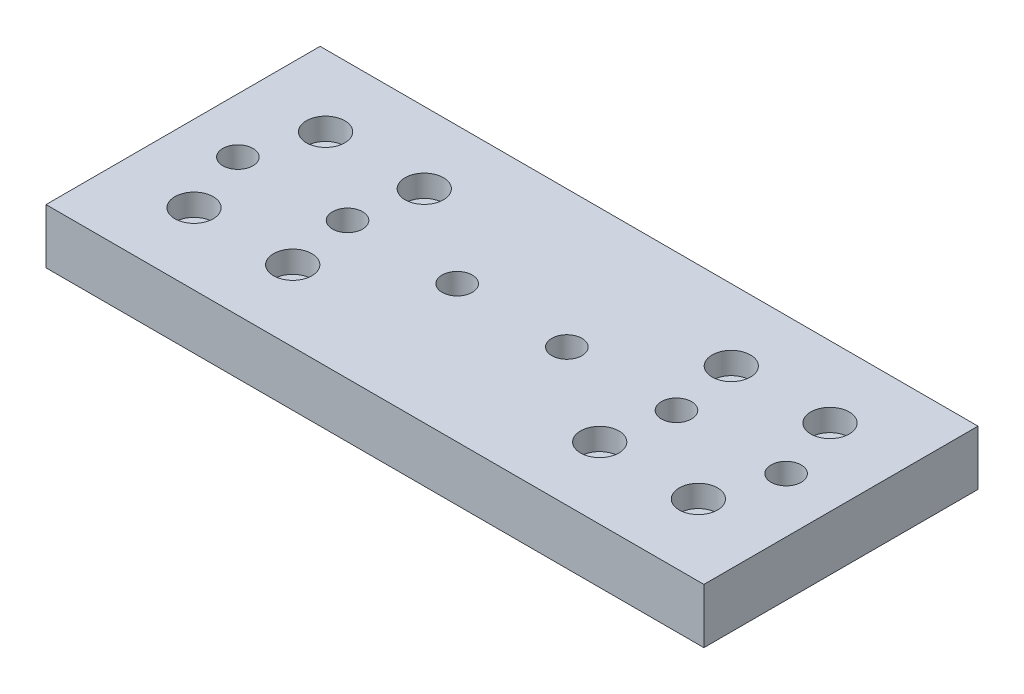
ISO-10303-21;
HEADER;
FILE_DESCRIPTION(('STEP AP214'),'2;1');
FILE_NAME('part.step','',(''),(''),'','','');
FILE_SCHEMA(('AUTOMOTIVE_DESIGN { 1 0 10303 214 1 1 1 1 }'));
ENDSEC;
DATA;
#1=APPLICATION_CONTEXT('core data for automotive mechanical design processes');
#2=APPLICATION_PROTOCOL_DEFINITION('international standard','automotive_design',2000,#1);
#3=PRODUCT_CONTEXT('',#1,'mechanical');
#4=PRODUCT('Part','Part','',(#3));
#5=PRODUCT_RELATED_PRODUCT_CATEGORY('part','',(#4));
#6=PRODUCT_DEFINITION_FORMATION('','',#4);
#7=PRODUCT_DEFINITION_CONTEXT('part definition',#1,'design');
#8=PRODUCT_DEFINITION('design','',#6,#7);
#9=PRODUCT_DEFINITION_SHAPE('','',#8);
#10=(LENGTH_UNIT() NAMED_UNIT(*) SI_UNIT(.MILLI.,.METRE.));
#11=(NAMED_UNIT(*) PLANE_ANGLE_UNIT() SI_UNIT($,.RADIAN.));
#12=(NAMED_UNIT(*) SI_UNIT($,.STERADIAN.) SOLID_ANGLE_UNIT());
#13=UNCERTAINTY_MEASURE_WITH_UNIT(LENGTH_MEASURE(1.E-05),#10,'distance_accuracy_value','');
#14=(GEOMETRIC_REPRESENTATION_CONTEXT(3) GLOBAL_UNCERTAINTY_ASSIGNED_CONTEXT((#13)) GLOBAL_UNIT_ASSIGNED_CONTEXT((#10,
#11,#12)) REPRESENTATION_CONTEXT('',''));
#15=CARTESIAN_POINT('',(0.,0.,0.));
#16=DIRECTION('',(0.,0.,1.));
#17=DIRECTION('',(1.,0.,0.));
#18=AXIS2_PLACEMENT_3D('',#15,#16,#17);
#19=CARTESIAN_POINT('',(0.,0.,0.));
#20=DIRECTION('',(0.,1.,0.));
#21=DIRECTION('',(0.,0.,1.));
#22=AXIS2_PLACEMENT_3D('',#19,#20,#21);
#23=PLANE('',#22);
#24=CARTESIAN_POINT('',(50.,0.,0.));
#25=DIRECTION('',(0.,-1.,0.));
#26=DIRECTION('',(0.,0.,-1.));
#27=AXIS2_PLACEMENT_3D('',#24,#25,#26);
#28=CIRCLE('',#27,5.735);
#29=CARTESIAN_POINT('',(50.,0.,-5.735));
#30=VERTEX_POINT('',#29);
#31=EDGE_CURVE('E472',#30,#30,#28,.T.);
#32=ORIENTED_EDGE('',*,*,#31,.F.);
#33=EDGE_LOOP('',(#32));
#34=FACE_BOUND('',#33,.T.);
#35=CARTESIAN_POINT('',(30.,0.,0.));
#36=DIRECTION('',(0.,-1.,0.));
#37=DIRECTION('',(0.,0.,-1.));
#38=AXIS2_PLACEMENT_3D('',#35,#36,#37);
#39=CIRCLE('',#38,5.735);
#40=CARTESIAN_POINT('',(30.,0.,-5.735));
#41=VERTEX_POINT('',#40);
#42=EDGE_CURVE('E479',#41,#41,#39,.T.);
#43=ORIENTED_EDGE('',*,*,#42,.F.);
#44=EDGE_LOOP('',(#43));
#45=FACE_BOUND('',#44,.T.);
#46=CARTESIAN_POINT('',(9.99999999999999,0.,0.));
#47=DIRECTION('',(0.,-1.,0.));
#48=DIRECTION('',(0.,0.,-1.));
#49=AXIS2_PLACEMENT_3D('',#46,#47,#48);
#50=CIRCLE('',#49,5.735);
#51=CARTESIAN_POINT('',(9.99999999999999,0.,-5.735));
#52=VERTEX_POINT('',#51);
#53=EDGE_CURVE('E488',#52,#52,#50,.T.);
#54=ORIENTED_EDGE('',*,*,#53,.F.);
#55=EDGE_LOOP('',(#54));
#56=FACE_BOUND('',#55,.T.);
#57=CARTESIAN_POINT('',(-10.,0.,0.));
#58=DIRECTION('',(0.,-1.,0.));
#59=DIRECTION('',(0.,0.,-1.));
#60=AXIS2_PLACEMENT_3D('',#57,#58,#59);
#61=CIRCLE('',#60,5.735);
#62=CARTESIAN_POINT('',(-10.,0.,-5.735));
#63=VERTEX_POINT('',#62);
#64=EDGE_CURVE('E497',#63,#63,#61,.T.);
#65=ORIENTED_EDGE('',*,*,#64,.F.);
#66=EDGE_LOOP('',(#65));
#67=FACE_BOUND('',#66,.T.);
#68=CARTESIAN_POINT('',(-30.,0.,0.));
#69=DIRECTION('',(0.,-1.,0.));
#70=DIRECTION('',(0.,0.,-1.));
#71=AXIS2_PLACEMENT_3D('',#68,#69,#70);
#72=CIRCLE('',#71,5.735);
#73=CARTESIAN_POINT('',(-30.,0.,-5.735));
#74=VERTEX_POINT('',#73);
#75=EDGE_CURVE('E506',#74,#74,#72,.T.);
#76=ORIENTED_EDGE('',*,*,#75,.F.);
#77=EDGE_LOOP('',(#76));
#78=FACE_BOUND('',#77,.T.);
#79=DIRECTION('',(0.,0.,1.));
#80=VECTOR('',#79,1.);
#81=CARTESIAN_POINT('',(-60.,0.,25.));
#82=LINE('',#81,#80);
#83=CARTESIAN_POINT('',(-60.,0.,-25.));
#84=VERTEX_POINT('',#83);
#85=CARTESIAN_POINT('',(-60.,0.,25.));
#86=VERTEX_POINT('',#85);
#87=EDGE_CURVE('E105',#84,#86,#82,.T.);
#88=ORIENTED_EDGE('',*,*,#87,.F.);
#89=DIRECTION('',(-1.,0.,0.));
#90=VECTOR('',#89,1.);
#91=CARTESIAN_POINT('',(60.,0.,-25.));
#92=LINE('',#91,#90);
#93=CARTESIAN_POINT('',(60.,0.,-25.));
#94=VERTEX_POINT('',#93);
#95=EDGE_CURVE('E80',#94,#84,#92,.T.);
#96=ORIENTED_EDGE('',*,*,#95,.F.);
#97=DIRECTION('',(0.,0.,-1.));
#98=VECTOR('',#97,1.);
#99=CARTESIAN_POINT('',(60.,0.,25.));
#100=LINE('',#99,#98);
#101=CARTESIAN_POINT('',(60.,0.,25.));
#102=VERTEX_POINT('',#101);
#103=EDGE_CURVE('E74',#102,#94,#100,.T.);
#104=ORIENTED_EDGE('',*,*,#103,.F.);
#105=DIRECTION('',(1.,0.,0.));
#106=VECTOR('',#105,1.);
#107=CARTESIAN_POINT('',(60.,0.,25.));
#108=LINE('',#107,#106);
#109=EDGE_CURVE('E96',#86,#102,#108,.T.);
#110=ORIENTED_EDGE('',*,*,#109,.F.);
#111=EDGE_LOOP('',(#88,#96,#104,#110));
#112=FACE_BOUND('',#111,.T.);
#113=CARTESIAN_POINT('',(-27.9999999999994,0.,11.9999999999998));
#114=DIRECTION('',(0.,1.,0.));
#115=DIRECTION('',(0.,0.,-1.));
#116=AXIS2_PLACEMENT_3D('',#113,#114,#115);
#117=CIRCLE('',#116,1.5);
#118=CARTESIAN_POINT('',(-27.9999999999994,0.,10.4999999999998));
#119=VERTEX_POINT('',#118);
#120=EDGE_CURVE('E108',#119,#119,#117,.T.);
#121=ORIENTED_EDGE('',*,*,#120,.T.);
#122=EDGE_LOOP('',(#121));
#123=FACE_BOUND('',#122,.T.);
#124=CARTESIAN_POINT('',(-45.9999999999994,0.,-11.9999999999998));
#125=DIRECTION('',(0.,1.,0.));
#126=DIRECTION('',(0.,0.,1.));
#127=AXIS2_PLACEMENT_3D('',#124,#125,#126);
#128=CIRCLE('',#127,1.5);
#129=CARTESIAN_POINT('',(-45.9999999999994,0.,-10.4999999999998));
#130=VERTEX_POINT('',#129);
#131=EDGE_CURVE('E146',#130,#130,#128,.T.);
#132=ORIENTED_EDGE('',*,*,#131,.T.);
#133=EDGE_LOOP('',(#132));
#134=FACE_BOUND('',#133,.T.);
#135=CARTESIAN_POINT('',(27.9999999999994,0.,-11.9999999999998));
#136=DIRECTION('',(0.,1.,0.));
#137=DIRECTION('',(0.,0.,-1.));
#138=AXIS2_PLACEMENT_3D('',#135,#136,#137);
#139=CIRCLE('',#138,1.5);
#140=CARTESIAN_POINT('',(27.9999999999994,0.,-13.4999999999998));
#141=VERTEX_POINT('',#140);
#142=EDGE_CURVE('E141',#141,#141,#139,.T.);
#143=ORIENTED_EDGE('',*,*,#142,.T.);
#144=EDGE_LOOP('',(#143));
#145=FACE_BOUND('',#144,.T.);
#146=CARTESIAN_POINT('',(-27.9999999999994,0.,-11.9999999999998));
#147=DIRECTION('',(0.,1.,0.));
#148=DIRECTION('',(0.,0.,1.));
#149=AXIS2_PLACEMENT_3D('',#146,#147,#148);
#150=CIRCLE('',#149,1.5);
#151=CARTESIAN_POINT('',(-27.9999999999994,0.,-10.4999999999998));
#152=VERTEX_POINT('',#151);
#153=EDGE_CURVE('E137',#152,#152,#150,.T.);
#154=ORIENTED_EDGE('',*,*,#153,.T.);
#155=EDGE_LOOP('',(#154));
#156=FACE_BOUND('',#155,.T.);
#157=CARTESIAN_POINT('',(45.9999999999994,0.,-11.9999999999997));
#158=DIRECTION('',(0.,1.,0.));
#159=DIRECTION('',(0.,0.,-1.));
#160=AXIS2_PLACEMENT_3D('',#157,#158,#159);
#161=CIRCLE('',#160,1.50000000000001);
#162=CARTESIAN_POINT('',(45.9999999999994,0.,-13.4999999999997));
#163=VERTEX_POINT('',#162);
#164=EDGE_CURVE('E153',#163,#163,#161,.T.);
#165=ORIENTED_EDGE('',*,*,#164,.T.);
#166=EDGE_LOOP('',(#165));
#167=FACE_BOUND('',#166,.T.);
#168=CARTESIAN_POINT('',(45.9999999999994,0.,11.9999999999999));
#169=DIRECTION('',(0.,1.,0.));
#170=DIRECTION('',(0.,0.,1.));
#171=AXIS2_PLACEMENT_3D('',#168,#169,#170);
#172=CIRCLE('',#171,1.5);
#173=CARTESIAN_POINT('',(45.9999999999994,0.,13.4999999999998));
#174=VERTEX_POINT('',#173);
#175=EDGE_CURVE('E161',#174,#174,#172,.T.);
#176=ORIENTED_EDGE('',*,*,#175,.T.);
#177=EDGE_LOOP('',(#176));
#178=FACE_BOUND('',#177,.T.);
#179=CARTESIAN_POINT('',(27.9999999999994,0.,11.9999999999999));
#180=DIRECTION('',(0.,1.,0.));
#181=DIRECTION('',(0.,0.,1.));
#182=AXIS2_PLACEMENT_3D('',#179,#180,#181);
#183=CIRCLE('',#182,1.5);
#184=CARTESIAN_POINT('',(27.9999999999994,0.,13.4999999999999));
#185=VERTEX_POINT('',#184);
#186=EDGE_CURVE('E158',#185,#185,#183,.T.);
#187=ORIENTED_EDGE('',*,*,#186,.T.);
#188=EDGE_LOOP('',(#187));
#189=FACE_BOUND('',#188,.T.);
#190=CARTESIAN_POINT('',(-45.9999999999994,0.,11.9999999999998));
#191=DIRECTION('',(0.,1.,0.));
#192=DIRECTION('',(0.,0.,-1.));
#193=AXIS2_PLACEMENT_3D('',#190,#191,#192);
#194=CIRCLE('',#193,1.5);
#195=CARTESIAN_POINT('',(-45.9999999999994,0.,10.4999999999998));
#196=VERTEX_POINT('',#195);
#197=EDGE_CURVE('E155',#196,#196,#194,.T.);
#198=ORIENTED_EDGE('',*,*,#197,.T.);
#199=EDGE_LOOP('',(#198));
#200=FACE_BOUND('',#199,.T.);
#201=CARTESIAN_POINT('',(-50.,0.,0.));
#202=DIRECTION('',(0.,-1.,0.));
#203=DIRECTION('',(0.,0.,-1.));
#204=AXIS2_PLACEMENT_3D('',#201,#202,#203);
#205=CIRCLE('',#204,5.735);
#206=CARTESIAN_POINT('',(-50.,0.,-5.735));
#207=VERTEX_POINT('',#206);
#208=EDGE_CURVE('E245',#207,#207,#205,.T.);
#209=ORIENTED_EDGE('',*,*,#208,.F.);
#210=EDGE_LOOP('',(#209));
#211=FACE_BOUND('',#210,.T.);
#212=ADVANCED_FACE('F38',(#34,#45,#56,#67,#78,#112,#123,#134,#145,#156,#167,#178,#189,#200,
#211),#23,.F.);
#213=CARTESIAN_POINT('',(-45.9999999999994,0.,-11.9999999999998));
#214=DIRECTION('',(0.,1.,0.));
#215=DIRECTION('',(0.,0.,1.));
#216=AXIS2_PLACEMENT_3D('',#213,#214,#215);
#217=CYLINDRICAL_SURFACE('',#216,1.5);
#218=ORIENTED_EDGE('',*,*,#131,.F.);
#219=EDGE_LOOP('',(#218));
#220=FACE_BOUND('',#219,.T.);
#221=CARTESIAN_POINT('',(-45.9999999999994,6.,-11.9999999999998));
#222=DIRECTION('',(0.,1.,0.));
#223=DIRECTION('',(0.,0.,1.));
#224=AXIS2_PLACEMENT_3D('',#221,#222,#223);
#225=CIRCLE('',#224,1.5);
#226=CARTESIAN_POINT('',(-45.9999999999994,6.,-10.4999999999998));
#227=VERTEX_POINT('',#226);
#228=EDGE_CURVE('E132',#227,#227,#225,.F.);
#229=ORIENTED_EDGE('',*,*,#228,.F.);
#230=EDGE_LOOP('',(#229));
#231=FACE_BOUND('',#230,.T.);
#232=ADVANCED_FACE('F188',(#220,#231),#217,.F.);
#233=CARTESIAN_POINT('',(-27.9999999999994,0.,-11.9999999999998));
#234=DIRECTION('',(0.,1.,0.));
#235=DIRECTION('',(0.,0.,1.));
#236=AXIS2_PLACEMENT_3D('',#233,#234,#235);
#237=CYLINDRICAL_SURFACE('',#236,1.5);
#238=ORIENTED_EDGE('',*,*,#153,.F.);
#239=EDGE_LOOP('',(#238));
#240=FACE_BOUND('',#239,.T.);
#241=CARTESIAN_POINT('',(-27.9999999999994,6.,-11.9999999999998));
#242=DIRECTION('',(0.,1.,0.));
#243=DIRECTION('',(0.,0.,1.));
#244=AXIS2_PLACEMENT_3D('',#241,#242,#243);
#245=CIRCLE('',#244,1.5);
#246=CARTESIAN_POINT('',(-27.9999999999994,6.,-10.4999999999998));
#247=VERTEX_POINT('',#246);
#248=EDGE_CURVE('E127',#247,#247,#245,.F.);
#249=ORIENTED_EDGE('',*,*,#248,.F.);
#250=EDGE_LOOP('',(#249));
#251=FACE_BOUND('',#250,.T.);
#252=ADVANCED_FACE('F195',(#240,#251),#237,.F.);
#253=CARTESIAN_POINT('',(45.9999999999994,0.,11.9999999999999));
#254=DIRECTION('',(0.,1.,0.));
#255=DIRECTION('',(0.,0.,1.));
#256=AXIS2_PLACEMENT_3D('',#253,#254,#255);
#257=CYLINDRICAL_SURFACE('',#256,1.5);
#258=ORIENTED_EDGE('',*,*,#175,.F.);
#259=EDGE_LOOP('',(#258));
#260=FACE_BOUND('',#259,.T.);
#261=CARTESIAN_POINT('',(45.9999999999994,6.,11.9999999999999));
#262=DIRECTION('',(0.,1.,0.));
#263=DIRECTION('',(0.,0.,1.));
#264=AXIS2_PLACEMENT_3D('',#261,#262,#263);
#265=CIRCLE('',#264,1.5);
#266=CARTESIAN_POINT('',(45.9999999999994,6.,13.4999999999998));
#267=VERTEX_POINT('',#266);
#268=EDGE_CURVE('E121',#267,#267,#265,.F.);
#269=ORIENTED_EDGE('',*,*,#268,.F.);
#270=EDGE_LOOP('',(#269));
#271=FACE_BOUND('',#270,.T.);
#272=ADVANCED_FACE('F212',(#260,#271),#257,.F.);
#273=CARTESIAN_POINT('',(27.9999999999994,0.,11.9999999999999));
#274=DIRECTION('',(0.,1.,0.));
#275=DIRECTION('',(0.,0.,1.));
#276=AXIS2_PLACEMENT_3D('',#273,#274,#275);
#277=CYLINDRICAL_SURFACE('',#276,1.5);
#278=ORIENTED_EDGE('',*,*,#186,.F.);
#279=EDGE_LOOP('',(#278));
#280=FACE_BOUND('',#279,.T.);
#281=CARTESIAN_POINT('',(27.9999999999994,6.,11.9999999999999));
#282=DIRECTION('',(0.,1.,0.));
#283=DIRECTION('',(0.,0.,1.));
#284=AXIS2_PLACEMENT_3D('',#281,#282,#283);
#285=CIRCLE('',#284,1.5);
#286=CARTESIAN_POINT('',(27.9999999999994,6.,13.4999999999999));
#287=VERTEX_POINT('',#286);
#288=EDGE_CURVE('E117',#287,#287,#285,.F.);
#289=ORIENTED_EDGE('',*,*,#288,.F.);
#290=EDGE_LOOP('',(#289));
#291=FACE_BOUND('',#290,.T.);
#292=ADVANCED_FACE('F208',(#280,#291),#277,.F.);
#293=CARTESIAN_POINT('',(-60.,10.,25.));
#294=DIRECTION('',(1.,0.,0.));
#295=DIRECTION('',(0.,0.,-1.));
#296=AXIS2_PLACEMENT_3D('',#293,#294,#295);
#297=PLANE('',#296);
#298=ORIENTED_EDGE('',*,*,#87,.T.);
#299=DIRECTION('',(0.,-1.,0.));
#300=VECTOR('',#299,1.);
#301=CARTESIAN_POINT('',(-60.,10.,25.));
#302=LINE('',#301,#300);
#303=CARTESIAN_POINT('',(-60.,10.,25.));
#304=VERTEX_POINT('',#303);
#305=EDGE_CURVE('E11',#304,#86,#302,.T.);
#306=ORIENTED_EDGE('',*,*,#305,.F.);
#307=DIRECTION('',(0.,0.,1.));
#308=VECTOR('',#307,1.);
#309=CARTESIAN_POINT('',(-60.,10.,25.));
#310=LINE('',#309,#308);
#311=CARTESIAN_POINT('',(-60.,10.,-25.));
#312=VERTEX_POINT('',#311);
#313=EDGE_CURVE('E92',#312,#304,#310,.T.);
#314=ORIENTED_EDGE('',*,*,#313,.F.);
#315=DIRECTION('',(0.,-1.,0.));
#316=VECTOR('',#315,1.);
#317=CARTESIAN_POINT('',(-60.,10.,-25.));
#318=LINE('',#317,#316);
#319=EDGE_CURVE('E101',#312,#84,#318,.T.);
#320=ORIENTED_EDGE('',*,*,#319,.T.);
#321=EDGE_LOOP('',(#298,#306,#314,#320));
#322=FACE_BOUND('',#321,.T.);
#323=ADVANCED_FACE('F40',(#322),#297,.F.);
#324=CARTESIAN_POINT('',(60.,10.,25.));
#325=DIRECTION('',(0.,0.,-1.));
#326=DIRECTION('',(-1.,0.,0.));
#327=AXIS2_PLACEMENT_3D('',#324,#325,#326);
#328=PLANE('',#327);
#329=ORIENTED_EDGE('',*,*,#109,.T.);
#330=DIRECTION('',(0.,-1.,0.));
#331=VECTOR('',#330,1.);
#332=CARTESIAN_POINT('',(60.,10.,25.));
#333=LINE('',#332,#331);
#334=CARTESIAN_POINT('',(60.,10.,25.));
#335=VERTEX_POINT('',#334);
#336=EDGE_CURVE('E48',#335,#102,#333,.T.);
#337=ORIENTED_EDGE('',*,*,#336,.F.);
#338=DIRECTION('',(1.,0.,0.));
#339=VECTOR('',#338,1.);
#340=CARTESIAN_POINT('',(60.,10.,25.));
#341=LINE('',#340,#339);
#342=EDGE_CURVE('E87',#304,#335,#341,.T.);
#343=ORIENTED_EDGE('',*,*,#342,.F.);
#344=ORIENTED_EDGE('',*,*,#305,.T.);
#345=EDGE_LOOP('',(#329,#337,#343,#344));
#346=FACE_BOUND('',#345,.T.);
#347=ADVANCED_FACE('F95',(#346),#328,.F.);
#348=CARTESIAN_POINT('',(60.,10.,25.));
#349=DIRECTION('',(-1.,0.,0.));
#350=DIRECTION('',(0.,0.,1.));
#351=AXIS2_PLACEMENT_3D('',#348,#349,#350);
#352=PLANE('',#351);
#353=ORIENTED_EDGE('',*,*,#103,.T.);
#354=DIRECTION('',(0.,-1.,0.));
#355=VECTOR('',#354,1.);
#356=CARTESIAN_POINT('',(60.,10.,-25.));
#357=LINE('',#356,#355);
#358=CARTESIAN_POINT('',(60.,10.,-25.));
#359=VERTEX_POINT('',#358);
#360=EDGE_CURVE('E97',#359,#94,#357,.T.);
#361=ORIENTED_EDGE('',*,*,#360,.F.);
#362=DIRECTION('',(0.,0.,-1.));
#363=VECTOR('',#362,1.);
#364=CARTESIAN_POINT('',(60.,10.,25.));
#365=LINE('',#364,#363);
#366=EDGE_CURVE('E90',#335,#359,#365,.T.);
#367=ORIENTED_EDGE('',*,*,#366,.F.);
#368=ORIENTED_EDGE('',*,*,#336,.T.);
#369=EDGE_LOOP('',(#353,#361,#367,#368));
#370=FACE_BOUND('',#369,.T.);
#371=ADVANCED_FACE('F99',(#370),#352,.F.);
#372=CARTESIAN_POINT('',(60.,10.,-25.));
#373=DIRECTION('',(0.,0.,1.));
#374=DIRECTION('',(1.,0.,0.));
#375=AXIS2_PLACEMENT_3D('',#372,#373,#374);
#376=PLANE('',#375);
#377=ORIENTED_EDGE('',*,*,#95,.T.);
#378=ORIENTED_EDGE('',*,*,#319,.F.);
#379=DIRECTION('',(-1.,0.,0.));
#380=VECTOR('',#379,1.);
#381=CARTESIAN_POINT('',(60.,10.,-25.));
#382=LINE('',#381,#380);
#383=EDGE_CURVE('E57',#359,#312,#382,.T.);
#384=ORIENTED_EDGE('',*,*,#383,.F.);
#385=ORIENTED_EDGE('',*,*,#360,.T.);
#386=EDGE_LOOP('',(#377,#378,#384,#385));
#387=FACE_BOUND('',#386,.T.);
#388=ADVANCED_FACE('F183',(#387),#376,.F.);
#389=CARTESIAN_POINT('',(0.,10.,0.));
#390=DIRECTION('',(0.,1.,0.));
#391=DIRECTION('',(0.,0.,1.));
#392=AXIS2_PLACEMENT_3D('',#389,#390,#391);
#393=PLANE('',#392);
#394=CARTESIAN_POINT('',(50.,10.,0.));
#395=DIRECTION('',(0.,-1.,0.));
#396=DIRECTION('',(0.,0.,-1.));
#397=AXIS2_PLACEMENT_3D('',#394,#395,#396);
#398=CIRCLE('',#397,2.75);
#399=CARTESIAN_POINT('',(50.,10.,-2.75));
#400=VERTEX_POINT('',#399);
#401=EDGE_CURVE('E474',#400,#400,#398,.T.);
#402=ORIENTED_EDGE('',*,*,#401,.T.);
#403=EDGE_LOOP('',(#402));
#404=FACE_BOUND('',#403,.T.);
#405=CARTESIAN_POINT('',(30.,10.,0.));
#406=DIRECTION('',(0.,-1.,0.));
#407=DIRECTION('',(0.,0.,-1.));
#408=AXIS2_PLACEMENT_3D('',#405,#406,#407);
#409=CIRCLE('',#408,2.75);
#410=CARTESIAN_POINT('',(30.,10.,-2.75));
#411=VERTEX_POINT('',#410);
#412=EDGE_CURVE('E485',#411,#411,#409,.T.);
#413=ORIENTED_EDGE('',*,*,#412,.T.);
#414=EDGE_LOOP('',(#413));
#415=FACE_BOUND('',#414,.T.);
#416=CARTESIAN_POINT('',(9.99999999999999,10.,0.));
#417=DIRECTION('',(0.,-1.,0.));
#418=DIRECTION('',(0.,0.,-1.));
#419=AXIS2_PLACEMENT_3D('',#416,#417,#418);
#420=CIRCLE('',#419,2.75);
#421=CARTESIAN_POINT('',(9.99999999999999,10.,-2.75));
#422=VERTEX_POINT('',#421);
#423=EDGE_CURVE('E494',#422,#422,#420,.T.);
#424=ORIENTED_EDGE('',*,*,#423,.T.);
#425=EDGE_LOOP('',(#424));
#426=FACE_BOUND('',#425,.T.);
#427=CARTESIAN_POINT('',(-10.,10.,0.));
#428=DIRECTION('',(0.,-1.,0.));
#429=DIRECTION('',(0.,0.,-1.));
#430=AXIS2_PLACEMENT_3D('',#427,#428,#429);
#431=CIRCLE('',#430,2.75);
#432=CARTESIAN_POINT('',(-10.,10.,-2.75));
#433=VERTEX_POINT('',#432);
#434=EDGE_CURVE('E503',#433,#433,#431,.T.);
#435=ORIENTED_EDGE('',*,*,#434,.T.);
#436=EDGE_LOOP('',(#435));
#437=FACE_BOUND('',#436,.T.);
#438=CARTESIAN_POINT('',(-30.,10.,0.));
#439=DIRECTION('',(0.,-1.,0.));
#440=DIRECTION('',(0.,0.,-1.));
#441=AXIS2_PLACEMENT_3D('',#438,#439,#440);
#442=CIRCLE('',#441,2.75);
#443=CARTESIAN_POINT('',(-30.,10.,-2.75));
#444=VERTEX_POINT('',#443);
#445=EDGE_CURVE('E248',#444,#444,#442,.T.);
#446=ORIENTED_EDGE('',*,*,#445,.T.);
#447=EDGE_LOOP('',(#446));
#448=FACE_BOUND('',#447,.T.);
#449=CARTESIAN_POINT('',(-50.,10.,0.));
#450=DIRECTION('',(0.,-1.,0.));
#451=DIRECTION('',(0.,0.,-1.));
#452=AXIS2_PLACEMENT_3D('',#449,#450,#451);
#453=CIRCLE('',#452,2.75);
#454=CARTESIAN_POINT('',(-50.,10.,-2.75));
#455=VERTEX_POINT('',#454);
#456=EDGE_CURVE('E251',#455,#455,#453,.T.);
#457=ORIENTED_EDGE('',*,*,#456,.T.);
#458=EDGE_LOOP('',(#457));
#459=FACE_BOUND('',#458,.T.);
#460=CARTESIAN_POINT('',(45.9999999999994,10.,11.9999999999999));
#461=DIRECTION('',(0.,1.,0.));
#462=DIRECTION('',(0.,0.,1.));
#463=AXIS2_PLACEMENT_3D('',#460,#461,#462);
#464=CIRCLE('',#463,3.50000000000001);
#465=CARTESIAN_POINT('',(45.9999999999994,10.,15.4999999999999));
#466=VERTEX_POINT('',#465);
#467=EDGE_CURVE('E264',#466,#466,#464,.T.);
#468=ORIENTED_EDGE('',*,*,#467,.F.);
#469=EDGE_LOOP('',(#468));
#470=FACE_BOUND('',#469,.T.);
#471=CARTESIAN_POINT('',(-45.9999999999994,10.,11.9999999999998));
#472=DIRECTION('',(0.,1.,0.));
#473=DIRECTION('',(0.,0.,-1.));
#474=AXIS2_PLACEMENT_3D('',#471,#472,#473);
#475=CIRCLE('',#474,3.5);
#476=CARTESIAN_POINT('',(-45.9999999999994,10.,8.49999999999978));
#477=VERTEX_POINT('',#476);
#478=EDGE_CURVE('E283',#477,#477,#475,.T.);
#479=ORIENTED_EDGE('',*,*,#478,.F.);
#480=EDGE_LOOP('',(#479));
#481=FACE_BOUND('',#480,.T.);
#482=CARTESIAN_POINT('',(-27.9999999999994,10.,11.9999999999998));
#483=DIRECTION('',(0.,1.,0.));
#484=DIRECTION('',(0.,0.,-1.));
#485=AXIS2_PLACEMENT_3D('',#482,#483,#484);
#486=CIRCLE('',#485,3.5);
#487=CARTESIAN_POINT('',(-27.9999999999994,10.,8.49999999999984));
#488=VERTEX_POINT('',#487);
#489=EDGE_CURVE('E282',#488,#488,#486,.T.);
#490=ORIENTED_EDGE('',*,*,#489,.F.);
#491=EDGE_LOOP('',(#490));
#492=FACE_BOUND('',#491,.T.);
#493=CARTESIAN_POINT('',(-27.9999999999994,10.,-11.9999999999998));
#494=DIRECTION('',(0.,1.,0.));
#495=DIRECTION('',(0.,0.,1.));
#496=AXIS2_PLACEMENT_3D('',#493,#494,#495);
#497=CIRCLE('',#496,3.5);
#498=CARTESIAN_POINT('',(-27.9999999999994,10.,-8.49999999999983));
#499=VERTEX_POINT('',#498);
#500=EDGE_CURVE('E294',#499,#499,#497,.T.);
#501=ORIENTED_EDGE('',*,*,#500,.F.);
#502=EDGE_LOOP('',(#501));
#503=FACE_BOUND('',#502,.T.);
#504=CARTESIAN_POINT('',(27.9999999999994,10.,11.9999999999999));
#505=DIRECTION('',(0.,1.,0.));
#506=DIRECTION('',(0.,0.,1.));
#507=AXIS2_PLACEMENT_3D('',#504,#505,#506);
#508=CIRCLE('',#507,3.5);
#509=CARTESIAN_POINT('',(27.9999999999994,10.,15.4999999999999));
#510=VERTEX_POINT('',#509);
#511=EDGE_CURVE('E265',#510,#510,#508,.T.);
#512=ORIENTED_EDGE('',*,*,#511,.F.);
#513=EDGE_LOOP('',(#512));
#514=FACE_BOUND('',#513,.T.);
#515=CARTESIAN_POINT('',(27.9999999999994,10.,-11.9999999999998));
#516=DIRECTION('',(0.,1.,0.));
#517=DIRECTION('',(0.,0.,-1.));
#518=AXIS2_PLACEMENT_3D('',#515,#516,#517);
#519=CIRCLE('',#518,3.5);
#520=CARTESIAN_POINT('',(27.9999999999994,10.,-15.4999999999998));
#521=VERTEX_POINT('',#520);
#522=EDGE_CURVE('E271',#521,#521,#519,.T.);
#523=ORIENTED_EDGE('',*,*,#522,.F.);
#524=EDGE_LOOP('',(#523));
#525=FACE_BOUND('',#524,.T.);
#526=CARTESIAN_POINT('',(45.9999999999994,10.,-11.9999999999997));
#527=DIRECTION('',(0.,1.,0.));
#528=DIRECTION('',(0.,0.,-1.));
#529=AXIS2_PLACEMENT_3D('',#526,#527,#528);
#530=CIRCLE('',#529,3.49999999999999);
#531=CARTESIAN_POINT('',(45.9999999999994,10.,-15.4999999999997));
#532=VERTEX_POINT('',#531);
#533=EDGE_CURVE('E260',#532,#532,#530,.T.);
#534=ORIENTED_EDGE('',*,*,#533,.F.);
#535=EDGE_LOOP('',(#534));
#536=FACE_BOUND('',#535,.T.);
#537=CARTESIAN_POINT('',(-45.9999999999994,10.,-11.9999999999998));
#538=DIRECTION('',(0.,1.,0.));
#539=DIRECTION('',(0.,0.,1.));
#540=AXIS2_PLACEMENT_3D('',#537,#538,#539);
#541=CIRCLE('',#540,3.5);
#542=CARTESIAN_POINT('',(-45.9999999999994,10.,-8.49999999999977));
#543=VERTEX_POINT('',#542);
#544=EDGE_CURVE('E150',#543,#543,#541,.T.);
#545=ORIENTED_EDGE('',*,*,#544,.F.);
#546=EDGE_LOOP('',(#545));
#547=FACE_BOUND('',#546,.T.);
#548=ORIENTED_EDGE('',*,*,#313,.T.);
#549=ORIENTED_EDGE('',*,*,#342,.T.);
#550=ORIENTED_EDGE('',*,*,#366,.T.);
#551=ORIENTED_EDGE('',*,*,#383,.T.);
#552=EDGE_LOOP('',(#548,#549,#550,#551));
#553=FACE_BOUND('',#552,.T.);
#554=ADVANCED_FACE('F88',(#404,#415,#426,#437,#448,#459,#470,#481,#492,#503,#514,#525,#536,#547,
#553),#393,.T.);
#555=CARTESIAN_POINT('',(-27.9999999999994,0.,11.9999999999998));
#556=DIRECTION('',(0.,1.,0.));
#557=DIRECTION('',(0.,0.,1.));
#558=AXIS2_PLACEMENT_3D('',#555,#556,#557);
#559=CYLINDRICAL_SURFACE('',#558,1.5);
#560=CARTESIAN_POINT('',(-27.9999999999994,6.,11.9999999999998));
#561=DIRECTION('',(0.,-1.,0.));
#562=DIRECTION('',(0.,0.,-1.));
#563=AXIS2_PLACEMENT_3D('',#560,#561,#562);
#564=CIRCLE('',#563,1.5);
#565=CARTESIAN_POINT('',(-27.9999999999994,6.,10.4999999999998));
#566=VERTEX_POINT('',#565);
#567=EDGE_CURVE('E42',#566,#566,#564,.F.);
#568=ORIENTED_EDGE('',*,*,#567,.T.);
#569=EDGE_LOOP('',(#568));
#570=FACE_BOUND('',#569,.T.);
#571=ORIENTED_EDGE('',*,*,#120,.F.);
#572=EDGE_LOOP('',(#571));
#573=FACE_BOUND('',#572,.T.);
#574=ADVANCED_FACE('F171',(#570,#573),#559,.F.);
#575=CARTESIAN_POINT('',(27.9999999999994,0.,-11.9999999999998));
#576=DIRECTION('',(0.,1.,0.));
#577=DIRECTION('',(0.,0.,1.));
#578=AXIS2_PLACEMENT_3D('',#575,#576,#577);
#579=CYLINDRICAL_SURFACE('',#578,1.5);
#580=CARTESIAN_POINT('',(27.9999999999994,6.,-11.9999999999998));
#581=DIRECTION('',(0.,-1.,0.));
#582=DIRECTION('',(0.,0.,-1.));
#583=AXIS2_PLACEMENT_3D('',#580,#581,#582);
#584=CIRCLE('',#583,1.5);
#585=CARTESIAN_POINT('',(27.9999999999994,6.,-13.4999999999998));
#586=VERTEX_POINT('',#585);
#587=EDGE_CURVE('E130',#586,#586,#584,.F.);
#588=ORIENTED_EDGE('',*,*,#587,.T.);
#589=EDGE_LOOP('',(#588));
#590=FACE_BOUND('',#589,.T.);
#591=ORIENTED_EDGE('',*,*,#142,.F.);
#592=EDGE_LOOP('',(#591));
#593=FACE_BOUND('',#592,.T.);
#594=ADVANCED_FACE('F173',(#590,#593),#579,.F.);
#595=CARTESIAN_POINT('',(45.9999999999994,0.,-11.9999999999997));
#596=DIRECTION('',(0.,1.,0.));
#597=DIRECTION('',(0.,0.,1.));
#598=AXIS2_PLACEMENT_3D('',#595,#596,#597);
#599=CYLINDRICAL_SURFACE('',#598,1.50000000000001);
#600=CARTESIAN_POINT('',(45.9999999999994,6.,-11.9999999999997));
#601=DIRECTION('',(0.,-1.,0.));
#602=DIRECTION('',(0.,0.,-1.));
#603=AXIS2_PLACEMENT_3D('',#600,#601,#602);
#604=CIRCLE('',#603,1.50000000000001);
#605=CARTESIAN_POINT('',(45.9999999999994,6.,-13.4999999999997));
#606=VERTEX_POINT('',#605);
#607=EDGE_CURVE('E124',#606,#606,#604,.F.);
#608=ORIENTED_EDGE('',*,*,#607,.T.);
#609=EDGE_LOOP('',(#608));
#610=FACE_BOUND('',#609,.T.);
#611=ORIENTED_EDGE('',*,*,#164,.F.);
#612=EDGE_LOOP('',(#611));
#613=FACE_BOUND('',#612,.T.);
#614=ADVANCED_FACE('F179',(#610,#613),#599,.F.);
#615=CARTESIAN_POINT('',(-45.9999999999994,0.,11.9999999999998));
#616=DIRECTION('',(0.,1.,0.));
#617=DIRECTION('',(0.,0.,1.));
#618=AXIS2_PLACEMENT_3D('',#615,#616,#617);
#619=CYLINDRICAL_SURFACE('',#618,1.5);
#620=CARTESIAN_POINT('',(-45.9999999999994,6.,11.9999999999998));
#621=DIRECTION('',(0.,-1.,0.));
#622=DIRECTION('',(0.,0.,-1.));
#623=AXIS2_PLACEMENT_3D('',#620,#621,#622);
#624=CIRCLE('',#623,1.5);
#625=CARTESIAN_POINT('',(-45.9999999999994,6.,10.4999999999998));
#626=VERTEX_POINT('',#625);
#627=EDGE_CURVE('E114',#626,#626,#624,.F.);
#628=ORIENTED_EDGE('',*,*,#627,.T.);
#629=EDGE_LOOP('',(#628));
#630=FACE_BOUND('',#629,.T.);
#631=ORIENTED_EDGE('',*,*,#197,.F.);
#632=EDGE_LOOP('',(#631));
#633=FACE_BOUND('',#632,.T.);
#634=ADVANCED_FACE('F225',(#630,#633),#619,.F.);
#635=CARTESIAN_POINT('',(-45.9999999999994,6.,11.9999999999998));
#636=DIRECTION('',(0.,-1.,0.));
#637=DIRECTION('',(0.,0.,-1.));
#638=AXIS2_PLACEMENT_3D('',#635,#636,#637);
#639=PLANE('',#638);
#640=CARTESIAN_POINT('',(-45.9999999999994,6.,11.9999999999998));
#641=DIRECTION('',(0.,1.,0.));
#642=DIRECTION('',(0.,0.,-1.));
#643=AXIS2_PLACEMENT_3D('',#640,#641,#642);
#644=CIRCLE('',#643,3.5);
#645=CARTESIAN_POINT('',(-45.9999999999994,6.,8.49999999999978));
#646=VERTEX_POINT('',#645);
#647=EDGE_CURVE('E279',#646,#646,#644,.T.);
#648=ORIENTED_EDGE('',*,*,#647,.T.);
#649=EDGE_LOOP('',(#648));
#650=FACE_BOUND('',#649,.T.);
#651=ORIENTED_EDGE('',*,*,#627,.F.);
#652=EDGE_LOOP('',(#651));
#653=FACE_BOUND('',#652,.T.);
#654=ADVANCED_FACE('F231',(#650,#653),#639,.F.);
#655=CARTESIAN_POINT('',(-45.9999999999994,6.,11.9999999999998));
#656=DIRECTION('',(0.,1.,0.));
#657=DIRECTION('',(0.,0.,1.));
#658=AXIS2_PLACEMENT_3D('',#655,#656,#657);
#659=CYLINDRICAL_SURFACE('',#658,3.5);
#660=ORIENTED_EDGE('',*,*,#647,.F.);
#661=EDGE_LOOP('',(#660));
#662=FACE_BOUND('',#661,.T.);
#663=ORIENTED_EDGE('',*,*,#478,.T.);
#664=EDGE_LOOP('',(#663));
#665=FACE_BOUND('',#664,.T.);
#666=ADVANCED_FACE('F390',(#662,#665),#659,.F.);
#667=CARTESIAN_POINT('',(27.9999999999994,6.,11.9999999999999));
#668=DIRECTION('',(0.,1.,0.));
#669=DIRECTION('',(0.,0.,1.));
#670=AXIS2_PLACEMENT_3D('',#667,#668,#669);
#671=PLANE('',#670);
#672=CARTESIAN_POINT('',(27.9999999999994,6.,11.9999999999999));
#673=DIRECTION('',(0.,1.,0.));
#674=DIRECTION('',(0.,0.,1.));
#675=AXIS2_PLACEMENT_3D('',#672,#673,#674);
#676=CIRCLE('',#675,3.5);
#677=CARTESIAN_POINT('',(27.9999999999994,6.,15.4999999999999));
#678=VERTEX_POINT('',#677);
#679=EDGE_CURVE('E261',#678,#678,#676,.T.);
#680=ORIENTED_EDGE('',*,*,#679,.T.);
#681=EDGE_LOOP('',(#680));
#682=FACE_BOUND('',#681,.T.);
#683=ORIENTED_EDGE('',*,*,#288,.T.);
#684=EDGE_LOOP('',(#683));
#685=FACE_BOUND('',#684,.T.);
#686=ADVANCED_FACE('F393',(#682,#685),#671,.T.);
#687=CARTESIAN_POINT('',(27.9999999999994,6.,11.9999999999999));
#688=DIRECTION('',(0.,1.,0.));
#689=DIRECTION('',(0.,0.,1.));
#690=AXIS2_PLACEMENT_3D('',#687,#688,#689);
#691=CYLINDRICAL_SURFACE('',#690,3.5);
#692=ORIENTED_EDGE('',*,*,#679,.F.);
#693=EDGE_LOOP('',(#692));
#694=FACE_BOUND('',#693,.T.);
#695=ORIENTED_EDGE('',*,*,#511,.T.);
#696=EDGE_LOOP('',(#695));
#697=FACE_BOUND('',#696,.T.);
#698=ADVANCED_FACE('F397',(#694,#697),#691,.F.);
#699=CARTESIAN_POINT('',(45.9999999999994,6.,11.9999999999999));
#700=DIRECTION('',(0.,1.,0.));
#701=DIRECTION('',(0.,0.,1.));
#702=AXIS2_PLACEMENT_3D('',#699,#700,#701);
#703=PLANE('',#702);
#704=CARTESIAN_POINT('',(45.9999999999994,6.,11.9999999999999));
#705=DIRECTION('',(0.,1.,0.));
#706=DIRECTION('',(0.,0.,1.));
#707=AXIS2_PLACEMENT_3D('',#704,#705,#706);
#708=CIRCLE('',#707,3.50000000000001);
#709=CARTESIAN_POINT('',(45.9999999999994,6.,15.4999999999999));
#710=VERTEX_POINT('',#709);
#711=EDGE_CURVE('E286',#710,#710,#708,.T.);
#712=ORIENTED_EDGE('',*,*,#711,.T.);
#713=EDGE_LOOP('',(#712));
#714=FACE_BOUND('',#713,.T.);
#715=ORIENTED_EDGE('',*,*,#268,.T.);
#716=EDGE_LOOP('',(#715));
#717=FACE_BOUND('',#716,.T.);
#718=ADVANCED_FACE('F395',(#714,#717),#703,.T.);
#719=CARTESIAN_POINT('',(45.9999999999994,6.,11.9999999999999));
#720=DIRECTION('',(0.,1.,0.));
#721=DIRECTION('',(0.,0.,1.));
#722=AXIS2_PLACEMENT_3D('',#719,#720,#721);
#723=CYLINDRICAL_SURFACE('',#722,3.50000000000001);
#724=ORIENTED_EDGE('',*,*,#711,.F.);
#725=EDGE_LOOP('',(#724));
#726=FACE_BOUND('',#725,.T.);
#727=ORIENTED_EDGE('',*,*,#467,.T.);
#728=EDGE_LOOP('',(#727));
#729=FACE_BOUND('',#728,.T.);
#730=ADVANCED_FACE('F349',(#726,#729),#723,.F.);
#731=CARTESIAN_POINT('',(45.9999999999994,6.,-11.9999999999997));
#732=DIRECTION('',(0.,-1.,0.));
#733=DIRECTION('',(0.,0.,-1.));
#734=AXIS2_PLACEMENT_3D('',#731,#732,#733);
#735=PLANE('',#734);
#736=CARTESIAN_POINT('',(45.9999999999994,6.,-11.9999999999997));
#737=DIRECTION('',(0.,1.,0.));
#738=DIRECTION('',(0.,0.,-1.));
#739=AXIS2_PLACEMENT_3D('',#736,#737,#738);
#740=CIRCLE('',#739,3.49999999999999);
#741=CARTESIAN_POINT('',(45.9999999999994,6.,-15.4999999999997));
#742=VERTEX_POINT('',#741);
#743=EDGE_CURVE('E274',#742,#742,#740,.T.);
#744=ORIENTED_EDGE('',*,*,#743,.T.);
#745=EDGE_LOOP('',(#744));
#746=FACE_BOUND('',#745,.T.);
#747=ORIENTED_EDGE('',*,*,#607,.F.);
#748=EDGE_LOOP('',(#747));
#749=FACE_BOUND('',#748,.T.);
#750=ADVANCED_FACE('F345',(#746,#749),#735,.F.);
#751=CARTESIAN_POINT('',(45.9999999999994,6.,-11.9999999999997));
#752=DIRECTION('',(0.,1.,0.));
#753=DIRECTION('',(0.,0.,1.));
#754=AXIS2_PLACEMENT_3D('',#751,#752,#753);
#755=CYLINDRICAL_SURFACE('',#754,3.49999999999999);
#756=ORIENTED_EDGE('',*,*,#743,.F.);
#757=EDGE_LOOP('',(#756));
#758=FACE_BOUND('',#757,.T.);
#759=ORIENTED_EDGE('',*,*,#533,.T.);
#760=EDGE_LOOP('',(#759));
#761=FACE_BOUND('',#760,.T.);
#762=ADVANCED_FACE('F335',(#758,#761),#755,.F.);
#763=CARTESIAN_POINT('',(-27.9999999999994,6.,-11.9999999999998));
#764=DIRECTION('',(0.,1.,0.));
#765=DIRECTION('',(0.,0.,1.));
#766=AXIS2_PLACEMENT_3D('',#763,#764,#765);
#767=PLANE('',#766);
#768=CARTESIAN_POINT('',(-27.9999999999994,6.,-11.9999999999998));
#769=DIRECTION('',(0.,1.,0.));
#770=DIRECTION('',(0.,0.,1.));
#771=AXIS2_PLACEMENT_3D('',#768,#769,#770);
#772=CIRCLE('',#771,3.5);
#773=CARTESIAN_POINT('',(-27.9999999999994,6.,-8.49999999999983));
#774=VERTEX_POINT('',#773);
#775=EDGE_CURVE('E291',#774,#774,#772,.T.);
#776=ORIENTED_EDGE('',*,*,#775,.T.);
#777=EDGE_LOOP('',(#776));
#778=FACE_BOUND('',#777,.T.);
#779=ORIENTED_EDGE('',*,*,#248,.T.);
#780=EDGE_LOOP('',(#779));
#781=FACE_BOUND('',#780,.T.);
#782=ADVANCED_FACE('F332',(#778,#781),#767,.T.);
#783=CARTESIAN_POINT('',(-27.9999999999994,6.,-11.9999999999998));
#784=DIRECTION('',(0.,1.,0.));
#785=DIRECTION('',(0.,0.,1.));
#786=AXIS2_PLACEMENT_3D('',#783,#784,#785);
#787=CYLINDRICAL_SURFACE('',#786,3.5);
#788=ORIENTED_EDGE('',*,*,#775,.F.);
#789=EDGE_LOOP('',(#788));
#790=FACE_BOUND('',#789,.T.);
#791=ORIENTED_EDGE('',*,*,#500,.T.);
#792=EDGE_LOOP('',(#791));
#793=FACE_BOUND('',#792,.T.);
#794=ADVANCED_FACE('F334',(#790,#793),#787,.F.);
#795=CARTESIAN_POINT('',(27.9999999999994,6.,-11.9999999999998));
#796=DIRECTION('',(0.,-1.,0.));
#797=DIRECTION('',(0.,0.,-1.));
#798=AXIS2_PLACEMENT_3D('',#795,#796,#797);
#799=PLANE('',#798);
#800=CARTESIAN_POINT('',(27.9999999999994,6.,-11.9999999999998));
#801=DIRECTION('',(0.,1.,0.));
#802=DIRECTION('',(0.,0.,-1.));
#803=AXIS2_PLACEMENT_3D('',#800,#801,#802);
#804=CIRCLE('',#803,3.5);
#805=CARTESIAN_POINT('',(27.9999999999994,6.,-15.4999999999998));
#806=VERTEX_POINT('',#805);
#807=EDGE_CURVE('E268',#806,#806,#804,.T.);
#808=ORIENTED_EDGE('',*,*,#807,.T.);
#809=EDGE_LOOP('',(#808));
#810=FACE_BOUND('',#809,.T.);
#811=ORIENTED_EDGE('',*,*,#587,.F.);
#812=EDGE_LOOP('',(#811));
#813=FACE_BOUND('',#812,.T.);
#814=ADVANCED_FACE('F342',(#810,#813),#799,.F.);
#815=CARTESIAN_POINT('',(27.9999999999994,6.,-11.9999999999998));
#816=DIRECTION('',(0.,1.,0.));
#817=DIRECTION('',(0.,0.,1.));
#818=AXIS2_PLACEMENT_3D('',#815,#816,#817);
#819=CYLINDRICAL_SURFACE('',#818,3.5);
#820=ORIENTED_EDGE('',*,*,#807,.F.);
#821=EDGE_LOOP('',(#820));
#822=FACE_BOUND('',#821,.T.);
#823=ORIENTED_EDGE('',*,*,#522,.T.);
#824=EDGE_LOOP('',(#823));
#825=FACE_BOUND('',#824,.T.);
#826=ADVANCED_FACE('F321',(#822,#825),#819,.F.);
#827=CARTESIAN_POINT('',(-45.9999999999994,6.,-11.9999999999998));
#828=DIRECTION('',(0.,1.,0.));
#829=DIRECTION('',(0.,0.,1.));
#830=AXIS2_PLACEMENT_3D('',#827,#828,#829);
#831=PLANE('',#830);
#832=CARTESIAN_POINT('',(-45.9999999999994,6.,-11.9999999999998));
#833=DIRECTION('',(0.,1.,0.));
#834=DIRECTION('',(0.,0.,1.));
#835=AXIS2_PLACEMENT_3D('',#832,#833,#834);
#836=CIRCLE('',#835,3.5);
#837=CARTESIAN_POINT('',(-45.9999999999994,6.,-8.49999999999977));
#838=VERTEX_POINT('',#837);
#839=EDGE_CURVE('E118',#838,#838,#836,.T.);
#840=ORIENTED_EDGE('',*,*,#839,.T.);
#841=EDGE_LOOP('',(#840));
#842=FACE_BOUND('',#841,.T.);
#843=ORIENTED_EDGE('',*,*,#228,.T.);
#844=EDGE_LOOP('',(#843));
#845=FACE_BOUND('',#844,.T.);
#846=ADVANCED_FACE('F311',(#842,#845),#831,.T.);
#847=CARTESIAN_POINT('',(-45.9999999999994,6.,-11.9999999999998));
#848=DIRECTION('',(0.,1.,0.));
#849=DIRECTION('',(0.,0.,1.));
#850=AXIS2_PLACEMENT_3D('',#847,#848,#849);
#851=CYLINDRICAL_SURFACE('',#850,3.5);
#852=ORIENTED_EDGE('',*,*,#839,.F.);
#853=EDGE_LOOP('',(#852));
#854=FACE_BOUND('',#853,.T.);
#855=ORIENTED_EDGE('',*,*,#544,.T.);
#856=EDGE_LOOP('',(#855));
#857=FACE_BOUND('',#856,.T.);
#858=ADVANCED_FACE('F307',(#854,#857),#851,.F.);
#859=CARTESIAN_POINT('',(-27.9999999999994,6.,11.9999999999998));
#860=DIRECTION('',(0.,-1.,0.));
#861=DIRECTION('',(0.,0.,-1.));
#862=AXIS2_PLACEMENT_3D('',#859,#860,#861);
#863=PLANE('',#862);
#864=CARTESIAN_POINT('',(-27.9999999999994,6.,11.9999999999998));
#865=DIRECTION('',(0.,1.,0.));
#866=DIRECTION('',(0.,0.,-1.));
#867=AXIS2_PLACEMENT_3D('',#864,#865,#866);
#868=CIRCLE('',#867,3.5);
#869=CARTESIAN_POINT('',(-27.9999999999994,6.,8.49999999999984));
#870=VERTEX_POINT('',#869);
#871=EDGE_CURVE('E297',#870,#870,#868,.T.);
#872=ORIENTED_EDGE('',*,*,#871,.T.);
#873=EDGE_LOOP('',(#872));
#874=FACE_BOUND('',#873,.T.);
#875=ORIENTED_EDGE('',*,*,#567,.F.);
#876=EDGE_LOOP('',(#875));
#877=FACE_BOUND('',#876,.T.);
#878=ADVANCED_FACE('F310',(#874,#877),#863,.F.);
#879=CARTESIAN_POINT('',(-27.9999999999994,6.,11.9999999999998));
#880=DIRECTION('',(0.,1.,0.));
#881=DIRECTION('',(0.,0.,1.));
#882=AXIS2_PLACEMENT_3D('',#879,#880,#881);
#883=CYLINDRICAL_SURFACE('',#882,3.5);
#884=ORIENTED_EDGE('',*,*,#871,.F.);
#885=EDGE_LOOP('',(#884));
#886=FACE_BOUND('',#885,.T.);
#887=ORIENTED_EDGE('',*,*,#489,.T.);
#888=EDGE_LOOP('',(#887));
#889=FACE_BOUND('',#888,.T.);
#890=ADVANCED_FACE('F318',(#886,#889),#883,.F.);
#891=CARTESIAN_POINT('',(-50.,0.,0.));
#892=DIRECTION('',(0.,-1.,0.));
#893=DIRECTION('',(0.,0.,-1.));
#894=AXIS2_PLACEMENT_3D('',#891,#892,#893);
#895=CYLINDRICAL_SURFACE('',#894,2.75);
#896=ORIENTED_EDGE('',*,*,#456,.F.);
#897=EDGE_LOOP('',(#896));
#898=FACE_BOUND('',#897,.T.);
#899=CARTESIAN_POINT('',(-50.,2.985,0.));
#900=DIRECTION('',(0.,-1.,0.));
#901=DIRECTION('',(0.,0.,-1.));
#902=AXIS2_PLACEMENT_3D('',#899,#900,#901);
#903=CIRCLE('',#902,2.75);
#904=CARTESIAN_POINT('',(-50.,2.985,-2.75));
#905=VERTEX_POINT('',#904);
#906=EDGE_CURVE('E247',#905,#905,#903,.T.);
#907=ORIENTED_EDGE('',*,*,#906,.T.);
#908=EDGE_LOOP('',(#907));
#909=FACE_BOUND('',#908,.T.);
#910=ADVANCED_FACE('F352',(#898,#909),#895,.F.);
#911=CARTESIAN_POINT('',(-50.,0.,0.));
#912=DIRECTION('',(0.,-1.,0.));
#913=DIRECTION('',(0.,0.,-1.));
#914=AXIS2_PLACEMENT_3D('',#911,#912,#913);
#915=CONICAL_SURFACE('',#914,5.735,0.78539816339745);
#916=ORIENTED_EDGE('',*,*,#906,.F.);
#917=EDGE_LOOP('',(#916));
#918=FACE_BOUND('',#917,.T.);
#919=ORIENTED_EDGE('',*,*,#208,.T.);
#920=EDGE_LOOP('',(#919));
#921=FACE_BOUND('',#920,.T.);
#922=ADVANCED_FACE('F357',(#918,#921),#915,.F.);
#923=CARTESIAN_POINT('',(-30.,0.,0.));
#924=DIRECTION('',(0.,-1.,0.));
#925=DIRECTION('',(0.,0.,-1.));
#926=AXIS2_PLACEMENT_3D('',#923,#924,#925);
#927=CYLINDRICAL_SURFACE('',#926,2.75);
#928=ORIENTED_EDGE('',*,*,#445,.F.);
#929=EDGE_LOOP('',(#928));
#930=FACE_BOUND('',#929,.T.);
#931=CARTESIAN_POINT('',(-30.,2.985,0.));
#932=DIRECTION('',(0.,-1.,0.));
#933=DIRECTION('',(0.,0.,-1.));
#934=AXIS2_PLACEMENT_3D('',#931,#932,#933);
#935=CIRCLE('',#934,2.75);
#936=CARTESIAN_POINT('',(-30.,2.985,-2.75));
#937=VERTEX_POINT('',#936);
#938=EDGE_CURVE('E254',#937,#937,#935,.T.);
#939=ORIENTED_EDGE('',*,*,#938,.T.);
#940=EDGE_LOOP('',(#939));
#941=FACE_BOUND('',#940,.T.);
#942=ADVANCED_FACE('F425',(#930,#941),#927,.F.);
#943=CARTESIAN_POINT('',(-30.,0.,0.));
#944=DIRECTION('',(0.,-1.,0.));
#945=DIRECTION('',(0.,0.,-1.));
#946=AXIS2_PLACEMENT_3D('',#943,#944,#945);
#947=CONICAL_SURFACE('',#946,5.735,0.785398163397448);
#948=ORIENTED_EDGE('',*,*,#938,.F.);
#949=EDGE_LOOP('',(#948));
#950=FACE_BOUND('',#949,.T.);
#951=ORIENTED_EDGE('',*,*,#75,.T.);
#952=EDGE_LOOP('',(#951));
#953=FACE_BOUND('',#952,.T.);
#954=ADVANCED_FACE('F429',(#950,#953),#947,.F.);
#955=CARTESIAN_POINT('',(-10.,0.,0.));
#956=DIRECTION('',(0.,-1.,0.));
#957=DIRECTION('',(0.,0.,-1.));
#958=AXIS2_PLACEMENT_3D('',#955,#956,#957);
#959=CYLINDRICAL_SURFACE('',#958,2.75);
#960=ORIENTED_EDGE('',*,*,#434,.F.);
#961=EDGE_LOOP('',(#960));
#962=FACE_BOUND('',#961,.T.);
#963=CARTESIAN_POINT('',(-10.,2.985,0.));
#964=DIRECTION('',(0.,-1.,0.));
#965=DIRECTION('',(0.,0.,-1.));
#966=AXIS2_PLACEMENT_3D('',#963,#964,#965);
#967=CIRCLE('',#966,2.75);
#968=CARTESIAN_POINT('',(-10.,2.985,-2.75));
#969=VERTEX_POINT('',#968);
#970=EDGE_CURVE('E500',#969,#969,#967,.T.);
#971=ORIENTED_EDGE('',*,*,#970,.T.);
#972=EDGE_LOOP('',(#971));
#973=FACE_BOUND('',#972,.T.);
#974=ADVANCED_FACE('F433',(#962,#973),#959,.F.);
#975=CARTESIAN_POINT('',(-10.,0.,0.));
#976=DIRECTION('',(0.,-1.,0.));
#977=DIRECTION('',(0.,0.,-1.));
#978=AXIS2_PLACEMENT_3D('',#975,#976,#977);
#979=CONICAL_SURFACE('',#978,5.735,0.785398163397448);
#980=ORIENTED_EDGE('',*,*,#970,.F.);
#981=EDGE_LOOP('',(#980));
#982=FACE_BOUND('',#981,.T.);
#983=ORIENTED_EDGE('',*,*,#64,.T.);
#984=EDGE_LOOP('',(#983));
#985=FACE_BOUND('',#984,.T.);
#986=ADVANCED_FACE('F437',(#982,#985),#979,.F.);
#987=CARTESIAN_POINT('',(9.99999999999999,0.,0.));
#988=DIRECTION('',(0.,-1.,0.));
#989=DIRECTION('',(0.,0.,-1.));
#990=AXIS2_PLACEMENT_3D('',#987,#988,#989);
#991=CYLINDRICAL_SURFACE('',#990,2.75);
#992=ORIENTED_EDGE('',*,*,#423,.F.);
#993=EDGE_LOOP('',(#992));
#994=FACE_BOUND('',#993,.T.);
#995=CARTESIAN_POINT('',(9.99999999999999,2.985,0.));
#996=DIRECTION('',(0.,-1.,0.));
#997=DIRECTION('',(0.,0.,-1.));
#998=AXIS2_PLACEMENT_3D('',#995,#996,#997);
#999=CIRCLE('',#998,2.75);
#1000=CARTESIAN_POINT('',(9.99999999999999,2.985,-2.75));
#1001=VERTEX_POINT('',#1000);
#1002=EDGE_CURVE('E491',#1001,#1001,#999,.T.);
#1003=ORIENTED_EDGE('',*,*,#1002,.T.);
#1004=EDGE_LOOP('',(#1003));
#1005=FACE_BOUND('',#1004,.T.);
#1006=ADVANCED_FACE('F441',(#994,#1005),#991,.F.);
#1007=CARTESIAN_POINT('',(9.99999999999999,0.,0.));
#1008=DIRECTION('',(0.,-1.,0.));
#1009=DIRECTION('',(0.,0.,-1.));
#1010=AXIS2_PLACEMENT_3D('',#1007,#1008,#1009);
#1011=CONICAL_SURFACE('',#1010,5.735,0.785398163397448);
#1012=ORIENTED_EDGE('',*,*,#1002,.F.);
#1013=EDGE_LOOP('',(#1012));
#1014=FACE_BOUND('',#1013,.T.);
#1015=ORIENTED_EDGE('',*,*,#53,.T.);
#1016=EDGE_LOOP('',(#1015));
#1017=FACE_BOUND('',#1016,.T.);
#1018=ADVANCED_FACE('F445',(#1014,#1017),#1011,.F.);
#1019=CARTESIAN_POINT('',(30.,0.,0.));
#1020=DIRECTION('',(0.,-1.,0.));
#1021=DIRECTION('',(0.,0.,-1.));
#1022=AXIS2_PLACEMENT_3D('',#1019,#1020,#1021);
#1023=CYLINDRICAL_SURFACE('',#1022,2.75);
#1024=ORIENTED_EDGE('',*,*,#412,.F.);
#1025=EDGE_LOOP('',(#1024));
#1026=FACE_BOUND('',#1025,.T.);
#1027=CARTESIAN_POINT('',(30.,2.985,0.));
#1028=DIRECTION('',(0.,-1.,0.));
#1029=DIRECTION('',(0.,0.,-1.));
#1030=AXIS2_PLACEMENT_3D('',#1027,#1028,#1029);
#1031=CIRCLE('',#1030,2.75);
#1032=CARTESIAN_POINT('',(30.,2.985,-2.75));
#1033=VERTEX_POINT('',#1032);
#1034=EDGE_CURVE('E482',#1033,#1033,#1031,.T.);
#1035=ORIENTED_EDGE('',*,*,#1034,.T.);
#1036=EDGE_LOOP('',(#1035));
#1037=FACE_BOUND('',#1036,.T.);
#1038=ADVANCED_FACE('F449',(#1026,#1037),#1023,.F.);
#1039=CARTESIAN_POINT('',(30.,0.,0.));
#1040=DIRECTION('',(0.,-1.,0.));
#1041=DIRECTION('',(0.,0.,-1.));
#1042=AXIS2_PLACEMENT_3D('',#1039,#1040,#1041);
#1043=CONICAL_SURFACE('',#1042,5.735,0.78539816339745);
#1044=ORIENTED_EDGE('',*,*,#1034,.F.);
#1045=EDGE_LOOP('',(#1044));
#1046=FACE_BOUND('',#1045,.T.);
#1047=ORIENTED_EDGE('',*,*,#42,.T.);
#1048=EDGE_LOOP('',(#1047));
#1049=FACE_BOUND('',#1048,.T.);
#1050=ADVANCED_FACE('F453',(#1046,#1049),#1043,.F.);
#1051=CARTESIAN_POINT('',(50.,0.,0.));
#1052=DIRECTION('',(0.,-1.,0.));
#1053=DIRECTION('',(0.,0.,-1.));
#1054=AXIS2_PLACEMENT_3D('',#1051,#1052,#1053);
#1055=CYLINDRICAL_SURFACE('',#1054,2.75);
#1056=ORIENTED_EDGE('',*,*,#401,.F.);
#1057=EDGE_LOOP('',(#1056));
#1058=FACE_BOUND('',#1057,.T.);
#1059=CARTESIAN_POINT('',(50.,2.985,0.));
#1060=DIRECTION('',(0.,-1.,0.));
#1061=DIRECTION('',(0.,0.,-1.));
#1062=AXIS2_PLACEMENT_3D('',#1059,#1060,#1061);
#1063=CIRCLE('',#1062,2.75);
#1064=CARTESIAN_POINT('',(50.,2.985,-2.75));
#1065=VERTEX_POINT('',#1064);
#1066=EDGE_CURVE('E470',#1065,#1065,#1063,.T.);
#1067=ORIENTED_EDGE('',*,*,#1066,.T.);
#1068=EDGE_LOOP('',(#1067));
#1069=FACE_BOUND('',#1068,.T.);
#1070=ADVANCED_FACE('F457',(#1058,#1069),#1055,.F.);
#1071=CARTESIAN_POINT('',(50.,0.,0.));
#1072=DIRECTION('',(0.,-1.,0.));
#1073=DIRECTION('',(0.,0.,-1.));
#1074=AXIS2_PLACEMENT_3D('',#1071,#1072,#1073);
#1075=CONICAL_SURFACE('',#1074,5.735,0.78539816339745);
#1076=ORIENTED_EDGE('',*,*,#1066,.F.);
#1077=EDGE_LOOP('',(#1076));
#1078=FACE_BOUND('',#1077,.T.);
#1079=ORIENTED_EDGE('',*,*,#31,.T.);
#1080=EDGE_LOOP('',(#1079));
#1081=FACE_BOUND('',#1080,.T.);
#1082=ADVANCED_FACE('F461',(#1078,#1081),#1075,.F.);
#1083=CLOSED_SHELL('',(#212,#232,#252,#272,#292,#323,#347,#371,#388,#554,#574,#594,#614,#634,
#654,#666,#686,#698,#718,#730,#750,#762,#782,#794,#814,#826,#846,#858,#878,#890,#910,#922,#942,
#954,#974,#986,#1006,#1018,#1038,#1050,#1070,#1082));
#1084=MANIFOLD_SOLID_BREP('B2',#1083);
#1085=ADVANCED_BREP_SHAPE_REPRESENTATION('',(#18,#1084),#14);
#1086=SHAPE_DEFINITION_REPRESENTATION(#9,#1085);
ENDSEC;
END-ISO-10303-21;
